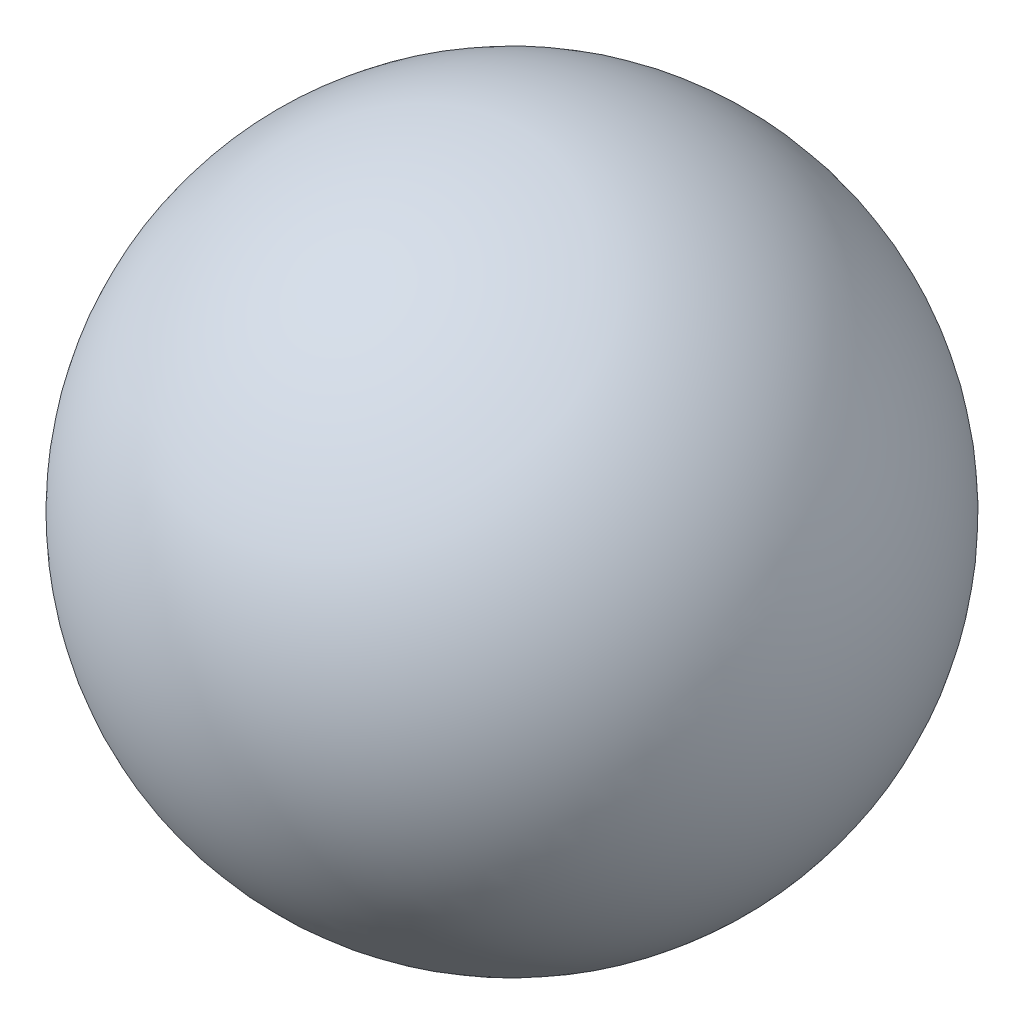
ISO-10303-21;
HEADER;
FILE_DESCRIPTION(('STEP AP214'),'2;1');
FILE_NAME('part.step','',(''),(''),'','','');
FILE_SCHEMA(('AUTOMOTIVE_DESIGN { 1 0 10303 214 1 1 1 1 }'));
ENDSEC;
DATA;
#1=APPLICATION_CONTEXT('core data for automotive mechanical design processes');
#2=APPLICATION_PROTOCOL_DEFINITION('international standard','automotive_design',2000,#1);
#3=PRODUCT_CONTEXT('',#1,'mechanical');
#4=PRODUCT('Part','Part','',(#3));
#5=PRODUCT_RELATED_PRODUCT_CATEGORY('part','',(#4));
#6=PRODUCT_DEFINITION_FORMATION('','',#4);
#7=PRODUCT_DEFINITION_CONTEXT('part definition',#1,'design');
#8=PRODUCT_DEFINITION('design','',#6,#7);
#9=PRODUCT_DEFINITION_SHAPE('','',#8);
#10=(LENGTH_UNIT() NAMED_UNIT(*) SI_UNIT(.MILLI.,.METRE.));
#11=(NAMED_UNIT(*) PLANE_ANGLE_UNIT() SI_UNIT($,.RADIAN.));
#12=(NAMED_UNIT(*) SI_UNIT($,.STERADIAN.) SOLID_ANGLE_UNIT());
#13=UNCERTAINTY_MEASURE_WITH_UNIT(LENGTH_MEASURE(1.E-05),#10,'distance_accuracy_value','');
#14=(GEOMETRIC_REPRESENTATION_CONTEXT(3) GLOBAL_UNCERTAINTY_ASSIGNED_CONTEXT((#13)) GLOBAL_UNIT_ASSIGNED_CONTEXT((#10,
#11,#12)) REPRESENTATION_CONTEXT('',''));
#15=CARTESIAN_POINT('',(0.,0.,0.));
#16=DIRECTION('',(0.,0.,1.));
#17=DIRECTION('',(1.,0.,0.));
#18=AXIS2_PLACEMENT_3D('',#15,#16,#17);
#19=CARTESIAN_POINT('',(57.535,-54.383794003142,-28.7841699910526));
#20=DIRECTION('',(0.,-0.88383663657057,-0.467795681741101));
#21=DIRECTION('',(0.173648177666933,0.460688814204268,-0.870409172090931));
#22=AXIS2_PLACEMENT_3D('',#19,#20,#21);
#23=SPHERICAL_SURFACE('',#22,6.75);
#24=CARTESIAN_POINT('',(57.535,-48.4178967062907,-25.6265491393002));
#25=VERTEX_POINT('',#24);
#26=VERTEX_LOOP('',#25);
#27=FACE_BOUND('',#26,.T.);
#28=CARTESIAN_POINT('',(57.535,-60.3496912999933,-31.941790842805));
#29=VERTEX_POINT('',#28);
#30=VERTEX_LOOP('',#29);
#31=FACE_BOUND('',#30,.T.);
#32=ADVANCED_FACE('F16',(#27,#31),#23,.T.);
#33=CLOSED_SHELL('',(#32));
#34=MANIFOLD_SOLID_BREP('B1',#33);
#35=ADVANCED_BREP_SHAPE_REPRESENTATION('',(#18,#34),#14);
#36=SHAPE_DEFINITION_REPRESENTATION(#9,#35);
ENDSEC;
END-ISO-10303-21;
